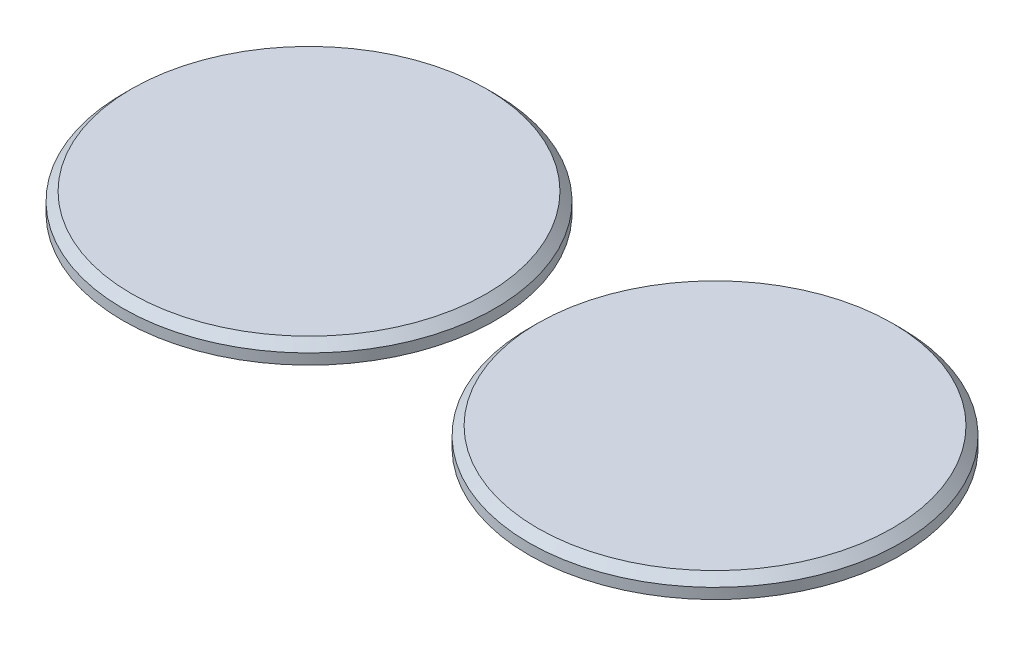
ISO-10303-21;
HEADER;
FILE_DESCRIPTION(('STEP AP214'),'2;1');
FILE_NAME('part.step','',(''),(''),'','','');
FILE_SCHEMA(('AUTOMOTIVE_DESIGN { 1 0 10303 214 1 1 1 1 }'));
ENDSEC;
DATA;
#1=APPLICATION_CONTEXT('core data for automotive mechanical design processes');
#2=APPLICATION_PROTOCOL_DEFINITION('international standard','automotive_design',2000,#1);
#3=PRODUCT_CONTEXT('',#1,'mechanical');
#4=PRODUCT('Part','Part','',(#3));
#5=PRODUCT_RELATED_PRODUCT_CATEGORY('part','',(#4));
#6=PRODUCT_DEFINITION_FORMATION('','',#4);
#7=PRODUCT_DEFINITION_CONTEXT('part definition',#1,'design');
#8=PRODUCT_DEFINITION('design','',#6,#7);
#9=PRODUCT_DEFINITION_SHAPE('','',#8);
#10=(LENGTH_UNIT() NAMED_UNIT(*) SI_UNIT(.MILLI.,.METRE.));
#11=(NAMED_UNIT(*) PLANE_ANGLE_UNIT() SI_UNIT($,.RADIAN.));
#12=(NAMED_UNIT(*) SI_UNIT($,.STERADIAN.) SOLID_ANGLE_UNIT());
#13=UNCERTAINTY_MEASURE_WITH_UNIT(LENGTH_MEASURE(1.E-05),#10,'distance_accuracy_value','');
#14=(GEOMETRIC_REPRESENTATION_CONTEXT(3) GLOBAL_UNCERTAINTY_ASSIGNED_CONTEXT((#13)) GLOBAL_UNIT_ASSIGNED_CONTEXT((#10,
#11,#12)) REPRESENTATION_CONTEXT('',''));
#15=CARTESIAN_POINT('',(0.,0.,0.));
#16=DIRECTION('',(0.,0.,1.));
#17=DIRECTION('',(1.,0.,0.));
#18=AXIS2_PLACEMENT_3D('',#15,#16,#17);
#19=CARTESIAN_POINT('',(91.9,1.55199999999997,-32.3));
#20=DIRECTION('',(0.,-1.,0.));
#21=DIRECTION('',(0.,0.,-1.));
#22=AXIS2_PLACEMENT_3D('',#19,#20,#21);
#23=CONICAL_SURFACE('',#22,27.3,0.78539816339745);
#24=CARTESIAN_POINT('',(91.9,1.55199999999997,-32.3));
#25=DIRECTION('',(0.,-1.,0.));
#26=DIRECTION('',(0.,0.,-1.));
#27=AXIS2_PLACEMENT_3D('',#24,#25,#26);
#28=CIRCLE('',#27,27.3);
#29=CARTESIAN_POINT('',(91.9,1.55199999999997,-59.6));
#30=VERTEX_POINT('',#29);
#31=EDGE_CURVE('E11',#30,#30,#28,.T.);
#32=ORIENTED_EDGE('',*,*,#31,.F.);
#33=EDGE_LOOP('',(#32));
#34=FACE_BOUND('',#33,.T.);
#35=CARTESIAN_POINT('',(91.9,2.802,-32.3));
#36=DIRECTION('',(0.,1.,0.));
#37=DIRECTION('',(0.,0.,1.));
#38=AXIS2_PLACEMENT_3D('',#35,#36,#37);
#39=CIRCLE('',#38,26.05);
#40=CARTESIAN_POINT('',(91.9,2.802,-6.25000000000002));
#41=VERTEX_POINT('',#40);
#42=EDGE_CURVE('E51',#41,#41,#39,.F.);
#43=ORIENTED_EDGE('',*,*,#42,.T.);
#44=EDGE_LOOP('',(#43));
#45=FACE_BOUND('',#44,.T.);
#46=ADVANCED_FACE('F47',(#34,#45),#23,.T.);
#47=CARTESIAN_POINT('',(0.,0.,0.));
#48=DIRECTION('',(0.,-1.,0.));
#49=DIRECTION('',(0.,0.,-1.));
#50=AXIS2_PLACEMENT_3D('',#47,#48,#49);
#51=PLANE('',#50);
#52=CARTESIAN_POINT('',(91.9,0.,-32.3));
#53=DIRECTION('',(0.,1.,0.));
#54=DIRECTION('',(0.,0.,1.));
#55=AXIS2_PLACEMENT_3D('',#52,#53,#54);
#56=CIRCLE('',#55,27.3);
#57=CARTESIAN_POINT('',(91.9,0.,-4.99999999999999));
#58=VERTEX_POINT('',#57);
#59=EDGE_CURVE('E55',#58,#58,#56,.T.);
#60=ORIENTED_EDGE('',*,*,#59,.F.);
#61=EDGE_LOOP('',(#60));
#62=FACE_BOUND('',#61,.T.);
#63=ADVANCED_FACE('F73',(#62),#51,.T.);
#64=CARTESIAN_POINT('',(91.9,0.,-32.3));
#65=DIRECTION('',(0.,1.,0.));
#66=DIRECTION('',(0.,0.,1.));
#67=AXIS2_PLACEMENT_3D('',#64,#65,#66);
#68=CYLINDRICAL_SURFACE('',#67,27.3);
#69=ORIENTED_EDGE('',*,*,#31,.T.);
#70=EDGE_LOOP('',(#69));
#71=FACE_BOUND('',#70,.T.);
#72=ORIENTED_EDGE('',*,*,#59,.T.);
#73=EDGE_LOOP('',(#72));
#74=FACE_BOUND('',#73,.T.);
#75=ADVANCED_FACE('F68',(#71,#74),#68,.T.);
#76=CARTESIAN_POINT('',(91.9,2.802,-32.3));
#77=DIRECTION('',(0.,1.,0.));
#78=DIRECTION('',(0.,0.,1.));
#79=AXIS2_PLACEMENT_3D('',#76,#77,#78);
#80=PLANE('',#79);
#81=ORIENTED_EDGE('',*,*,#42,.F.);
#82=EDGE_LOOP('',(#81));
#83=FACE_BOUND('',#82,.T.);
#84=ADVANCED_FACE('F66',(#83),#80,.T.);
#85=CLOSED_SHELL('',(#46,#63,#75,#84));
#86=MANIFOLD_SOLID_BREP('B2',#85);
#87=CARTESIAN_POINT('',(32.3,1.55199999999998,-32.3));
#88=DIRECTION('',(0.,-1.,0.));
#89=DIRECTION('',(0.,0.,-1.));
#90=AXIS2_PLACEMENT_3D('',#87,#88,#89);
#91=CONICAL_SURFACE('',#90,27.3,0.78539816339745);
#92=CARTESIAN_POINT('',(32.3,1.55199999999998,-32.3));
#93=DIRECTION('',(0.,-1.,0.));
#94=DIRECTION('',(0.,0.,-1.));
#95=AXIS2_PLACEMENT_3D('',#92,#93,#94);
#96=CIRCLE('',#95,27.3);
#97=CARTESIAN_POINT('',(32.3,1.55199999999998,-59.6));
#98=VERTEX_POINT('',#97);
#99=EDGE_CURVE('E46',#98,#98,#96,.T.);
#100=ORIENTED_EDGE('',*,*,#99,.F.);
#101=EDGE_LOOP('',(#100));
#102=FACE_BOUND('',#101,.T.);
#103=CARTESIAN_POINT('',(32.3,2.802,-32.3));
#104=DIRECTION('',(0.,1.,0.));
#105=DIRECTION('',(0.,0.,1.));
#106=AXIS2_PLACEMENT_3D('',#103,#104,#105);
#107=CIRCLE('',#106,26.05);
#108=CARTESIAN_POINT('',(32.3,2.802,-6.25000000000002));
#109=VERTEX_POINT('',#108);
#110=EDGE_CURVE('E126',#109,#109,#107,.F.);
#111=ORIENTED_EDGE('',*,*,#110,.T.);
#112=EDGE_LOOP('',(#111));
#113=FACE_BOUND('',#112,.T.);
#114=ADVANCED_FACE('F122',(#102,#113),#91,.T.);
#115=CARTESIAN_POINT('',(0.,0.,0.));
#116=DIRECTION('',(0.,-1.,0.));
#117=DIRECTION('',(0.,0.,-1.));
#118=AXIS2_PLACEMENT_3D('',#115,#116,#117);
#119=PLANE('',#118);
#120=CARTESIAN_POINT('',(32.3,0.,-32.3));
#121=DIRECTION('',(0.,1.,0.));
#122=DIRECTION('',(0.,0.,1.));
#123=AXIS2_PLACEMENT_3D('',#120,#121,#122);
#124=CIRCLE('',#123,27.3);
#125=CARTESIAN_POINT('',(32.3,0.,-5.));
#126=VERTEX_POINT('',#125);
#127=EDGE_CURVE('E130',#126,#126,#124,.T.);
#128=ORIENTED_EDGE('',*,*,#127,.F.);
#129=EDGE_LOOP('',(#128));
#130=FACE_BOUND('',#129,.T.);
#131=ADVANCED_FACE('F148',(#130),#119,.T.);
#132=CARTESIAN_POINT('',(32.3,0.,-32.3));
#133=DIRECTION('',(0.,1.,0.));
#134=DIRECTION('',(0.,0.,1.));
#135=AXIS2_PLACEMENT_3D('',#132,#133,#134);
#136=CYLINDRICAL_SURFACE('',#135,27.3);
#137=ORIENTED_EDGE('',*,*,#99,.T.);
#138=EDGE_LOOP('',(#137));
#139=FACE_BOUND('',#138,.T.);
#140=ORIENTED_EDGE('',*,*,#127,.T.);
#141=EDGE_LOOP('',(#140));
#142=FACE_BOUND('',#141,.T.);
#143=ADVANCED_FACE('F143',(#139,#142),#136,.T.);
#144=CARTESIAN_POINT('',(32.3,2.802,-32.3));
#145=DIRECTION('',(0.,1.,0.));
#146=DIRECTION('',(0.,0.,1.));
#147=AXIS2_PLACEMENT_3D('',#144,#145,#146);
#148=PLANE('',#147);
#149=ORIENTED_EDGE('',*,*,#110,.F.);
#150=EDGE_LOOP('',(#149));
#151=FACE_BOUND('',#150,.T.);
#152=ADVANCED_FACE('F141',(#151),#148,.T.);
#153=CLOSED_SHELL('',(#114,#131,#143,#152));
#154=MANIFOLD_SOLID_BREP('B6',#153);
#155=ADVANCED_BREP_SHAPE_REPRESENTATION('',(#18,#86,#154),#14);
#156=SHAPE_DEFINITION_REPRESENTATION(#9,#155);
ENDSEC;
END-ISO-10303-21;
